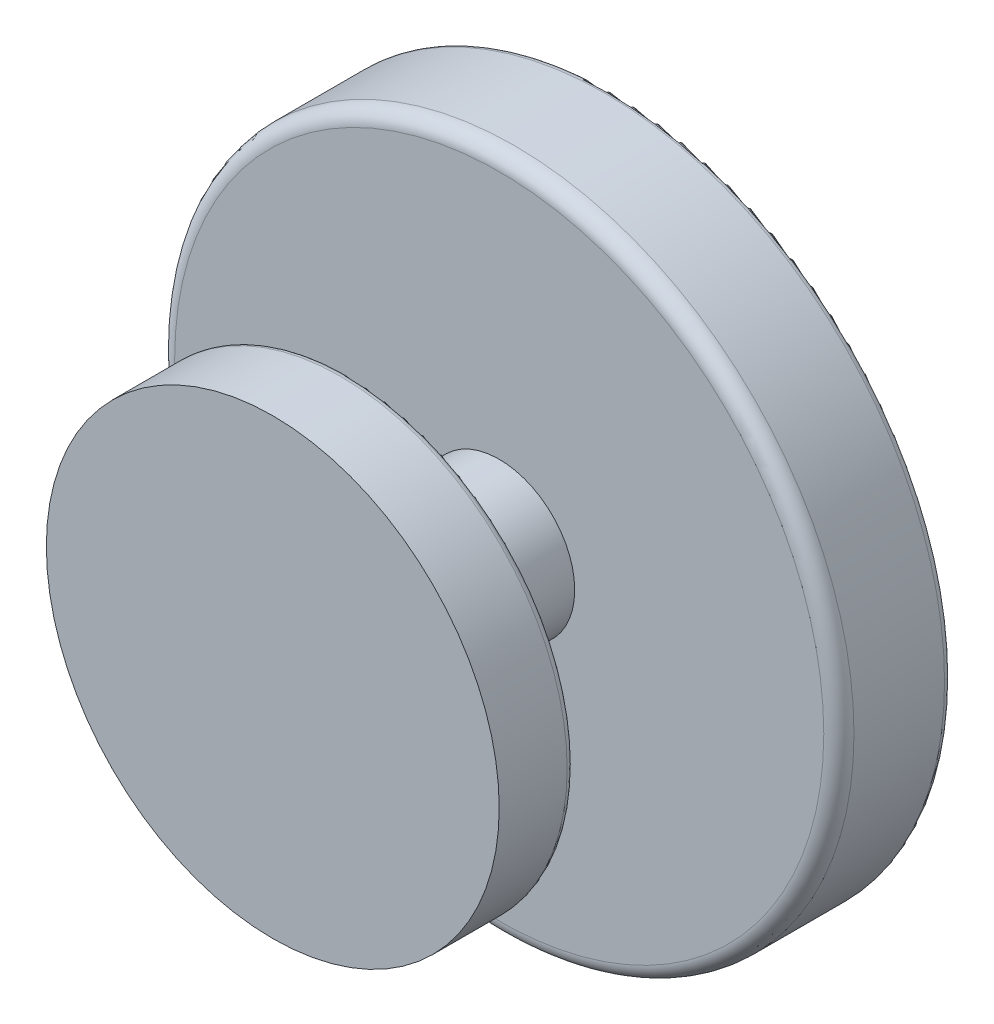
ISO-10303-21;
HEADER;
FILE_DESCRIPTION(('STEP AP214'),'2;1');
FILE_NAME('part.step','',(''),(''),'','','');
FILE_SCHEMA(('AUTOMOTIVE_DESIGN { 1 0 10303 214 1 1 1 1 }'));
ENDSEC;
DATA;
#1=APPLICATION_CONTEXT('core data for automotive mechanical design processes');
#2=APPLICATION_PROTOCOL_DEFINITION('international standard','automotive_design',2000,#1);
#3=PRODUCT_CONTEXT('',#1,'mechanical');
#4=PRODUCT('Part','Part','',(#3));
#5=PRODUCT_RELATED_PRODUCT_CATEGORY('part','',(#4));
#6=PRODUCT_DEFINITION_FORMATION('','',#4);
#7=PRODUCT_DEFINITION_CONTEXT('part definition',#1,'design');
#8=PRODUCT_DEFINITION('design','',#6,#7);
#9=PRODUCT_DEFINITION_SHAPE('','',#8);
#10=(LENGTH_UNIT() NAMED_UNIT(*) SI_UNIT(.MILLI.,.METRE.));
#11=(NAMED_UNIT(*) PLANE_ANGLE_UNIT() SI_UNIT($,.RADIAN.));
#12=(NAMED_UNIT(*) SI_UNIT($,.STERADIAN.) SOLID_ANGLE_UNIT());
#13=UNCERTAINTY_MEASURE_WITH_UNIT(LENGTH_MEASURE(1.E-05),#10,'distance_accuracy_value','');
#14=(GEOMETRIC_REPRESENTATION_CONTEXT(3) GLOBAL_UNCERTAINTY_ASSIGNED_CONTEXT((#13)) GLOBAL_UNIT_ASSIGNED_CONTEXT((#10,
#11,#12)) REPRESENTATION_CONTEXT('',''));
#15=CARTESIAN_POINT('',(0.,0.,0.));
#16=DIRECTION('',(0.,0.,1.));
#17=DIRECTION('',(1.,0.,0.));
#18=AXIS2_PLACEMENT_3D('',#15,#16,#17);
#19=CARTESIAN_POINT('',(0.,0.,15.));
#20=DIRECTION('',(0.,0.,1.));
#21=DIRECTION('',(1.,0.,0.));
#22=AXIS2_PLACEMENT_3D('',#19,#20,#21);
#23=PLANE('',#22);
#24=CARTESIAN_POINT('',(0.,0.,15.));
#25=DIRECTION('',(0.,0.,1.));
#26=DIRECTION('',(1.,0.,0.));
#27=AXIS2_PLACEMENT_3D('',#24,#25,#26);
#28=CIRCLE('',#27,43.);
#29=CARTESIAN_POINT('',(43.,0.,15.));
#30=VERTEX_POINT('',#29);
#31=EDGE_CURVE('E56',#30,#30,#28,.T.);
#32=ORIENTED_EDGE('',*,*,#31,.T.);
#33=EDGE_LOOP('',(#32));
#34=FACE_BOUND('',#33,.T.);
#35=CARTESIAN_POINT('',(0.,0.,15.));
#36=DIRECTION('',(0.,0.,1.));
#37=DIRECTION('',(1.,0.,0.));
#38=AXIS2_PLACEMENT_3D('',#35,#36,#37);
#39=CIRCLE('',#38,10.);
#40=CARTESIAN_POINT('',(10.,0.,15.));
#41=VERTEX_POINT('',#40);
#42=EDGE_CURVE('E60',#41,#41,#39,.T.);
#43=ORIENTED_EDGE('',*,*,#42,.F.);
#44=EDGE_LOOP('',(#43));
#45=FACE_BOUND('',#44,.T.);
#46=ADVANCED_FACE('F33',(#34,#45),#23,.T.);
#47=CARTESIAN_POINT('',(0.,0.,15.));
#48=DIRECTION('',(0.,0.,-1.));
#49=DIRECTION('',(-1.,0.,0.));
#50=AXIS2_PLACEMENT_3D('',#47,#48,#49);
#51=CYLINDRICAL_SURFACE('',#50,45.);
#52=CARTESIAN_POINT('',(0.,0.,1.));
#53=DIRECTION('',(0.,0.,1.));
#54=DIRECTION('',(1.,0.,0.));
#55=AXIS2_PLACEMENT_3D('',#52,#53,#54);
#56=CIRCLE('',#55,45.);
#57=CARTESIAN_POINT('',(45.,0.,1.));
#58=VERTEX_POINT('',#57);
#59=EDGE_CURVE('E40',#58,#58,#56,.T.);
#60=ORIENTED_EDGE('',*,*,#59,.T.);
#61=EDGE_LOOP('',(#60));
#62=FACE_BOUND('',#61,.T.);
#63=CARTESIAN_POINT('',(0.,0.,13.));
#64=DIRECTION('',(0.,0.,1.));
#65=DIRECTION('',(1.,0.,0.));
#66=AXIS2_PLACEMENT_3D('',#63,#64,#65);
#67=CIRCLE('',#66,45.);
#68=CARTESIAN_POINT('',(45.,0.,13.));
#69=VERTEX_POINT('',#68);
#70=EDGE_CURVE('E53',#69,#69,#67,.F.);
#71=ORIENTED_EDGE('',*,*,#70,.T.);
#72=EDGE_LOOP('',(#71));
#73=FACE_BOUND('',#72,.T.);
#74=ADVANCED_FACE('F87',(#62,#73),#51,.T.);
#75=CARTESIAN_POINT('',(0.,0.,0.));
#76=DIRECTION('',(0.,0.,1.));
#77=DIRECTION('',(1.,0.,0.));
#78=AXIS2_PLACEMENT_3D('',#75,#76,#77);
#79=PLANE('',#78);
#80=CARTESIAN_POINT('',(0.,0.,0.));
#81=DIRECTION('',(0.,0.,1.));
#82=DIRECTION('',(1.,0.,0.));
#83=AXIS2_PLACEMENT_3D('',#80,#81,#82);
#84=CIRCLE('',#83,44.);
#85=CARTESIAN_POINT('',(44.,0.,0.));
#86=VERTEX_POINT('',#85);
#87=EDGE_CURVE('E10',#86,#86,#84,.F.);
#88=ORIENTED_EDGE('',*,*,#87,.T.);
#89=EDGE_LOOP('',(#88));
#90=FACE_BOUND('',#89,.T.);
#91=ADVANCED_FACE('F93',(#90),#79,.F.);
#92=CARTESIAN_POINT('',(0.,0.,35.));
#93=DIRECTION('',(0.,0.,-1.));
#94=DIRECTION('',(-1.,0.,0.));
#95=AXIS2_PLACEMENT_3D('',#92,#93,#94);
#96=CYLINDRICAL_SURFACE('',#95,10.);
#97=CARTESIAN_POINT('',(0.,0.,35.));
#98=DIRECTION('',(0.,0.,1.));
#99=DIRECTION('',(1.,0.,0.));
#100=AXIS2_PLACEMENT_3D('',#97,#98,#99);
#101=CIRCLE('',#100,10.);
#102=CARTESIAN_POINT('',(10.,0.,35.));
#103=VERTEX_POINT('',#102);
#104=EDGE_CURVE('E59',#103,#103,#101,.T.);
#105=ORIENTED_EDGE('',*,*,#104,.F.);
#106=EDGE_LOOP('',(#105));
#107=FACE_BOUND('',#106,.T.);
#108=ORIENTED_EDGE('',*,*,#42,.T.);
#109=EDGE_LOOP('',(#108));
#110=FACE_BOUND('',#109,.T.);
#111=ADVANCED_FACE('F82',(#107,#110),#96,.T.);
#112=CARTESIAN_POINT('',(0.,0.,35.));
#113=DIRECTION('',(0.,0.,1.));
#114=DIRECTION('',(1.,0.,0.));
#115=AXIS2_PLACEMENT_3D('',#112,#113,#114);
#116=PLANE('',#115);
#117=CARTESIAN_POINT('',(0.,0.,35.));
#118=DIRECTION('',(0.,0.,1.));
#119=DIRECTION('',(1.,0.,0.));
#120=AXIS2_PLACEMENT_3D('',#117,#118,#119);
#121=CIRCLE('',#120,29.);
#122=CARTESIAN_POINT('',(29.,0.,35.));
#123=VERTEX_POINT('',#122);
#124=EDGE_CURVE('E44',#123,#123,#121,.F.);
#125=ORIENTED_EDGE('',*,*,#124,.T.);
#126=EDGE_LOOP('',(#125));
#127=FACE_BOUND('',#126,.T.);
#128=ORIENTED_EDGE('',*,*,#104,.T.);
#129=EDGE_LOOP('',(#128));
#130=FACE_BOUND('',#129,.T.);
#131=ADVANCED_FACE('F73',(#127,#130),#116,.F.);
#132=CARTESIAN_POINT('',(0.,0.,45.));
#133=DIRECTION('',(0.,0.,-1.));
#134=DIRECTION('',(-1.,0.,0.));
#135=AXIS2_PLACEMENT_3D('',#132,#133,#134);
#136=CYLINDRICAL_SURFACE('',#135,30.);
#137=CARTESIAN_POINT('',(0.,0.,36.));
#138=DIRECTION('',(0.,0.,1.));
#139=DIRECTION('',(1.,0.,0.));
#140=AXIS2_PLACEMENT_3D('',#137,#138,#139);
#141=CIRCLE('',#140,30.);
#142=CARTESIAN_POINT('',(30.,0.,36.));
#143=VERTEX_POINT('',#142);
#144=EDGE_CURVE('E48',#143,#143,#141,.T.);
#145=ORIENTED_EDGE('',*,*,#144,.T.);
#146=EDGE_LOOP('',(#145));
#147=FACE_BOUND('',#146,.T.);
#148=CARTESIAN_POINT('',(0.,0.,45.));
#149=DIRECTION('',(0.,0.,1.));
#150=DIRECTION('',(1.,0.,0.));
#151=AXIS2_PLACEMENT_3D('',#148,#149,#150);
#152=CIRCLE('',#151,30.);
#153=CARTESIAN_POINT('',(30.,0.,45.));
#154=VERTEX_POINT('',#153);
#155=EDGE_CURVE('E63',#154,#154,#152,.T.);
#156=ORIENTED_EDGE('',*,*,#155,.F.);
#157=EDGE_LOOP('',(#156));
#158=FACE_BOUND('',#157,.T.);
#159=ADVANCED_FACE('F71',(#147,#158),#136,.T.);
#160=CARTESIAN_POINT('',(0.,0.,45.));
#161=DIRECTION('',(0.,0.,1.));
#162=DIRECTION('',(1.,0.,0.));
#163=AXIS2_PLACEMENT_3D('',#160,#161,#162);
#164=PLANE('',#163);
#165=ORIENTED_EDGE('',*,*,#155,.T.);
#166=EDGE_LOOP('',(#165));
#167=FACE_BOUND('',#166,.T.);
#168=ADVANCED_FACE('F69',(#167),#164,.T.);
#169=CARTESIAN_POINT('',(0.,0.,13.));
#170=DIRECTION('',(0.,0.,1.));
#171=DIRECTION('',(1.,0.,0.));
#172=AXIS2_PLACEMENT_3D('',#169,#170,#171);
#173=TOROIDAL_SURFACE('',#172,43.,2.);
#174=ORIENTED_EDGE('',*,*,#70,.F.);
#175=EDGE_LOOP('',(#174));
#176=FACE_BOUND('',#175,.T.);
#177=ORIENTED_EDGE('',*,*,#31,.F.);
#178=EDGE_LOOP('',(#177));
#179=FACE_BOUND('',#178,.T.);
#180=ADVANCED_FACE('F80',(#176,#179),#173,.T.);
#181=CARTESIAN_POINT('',(0.,0.,36.));
#182=DIRECTION('',(0.,0.,1.));
#183=DIRECTION('',(1.,0.,0.));
#184=AXIS2_PLACEMENT_3D('',#181,#182,#183);
#185=TOROIDAL_SURFACE('',#184,29.,1.);
#186=ORIENTED_EDGE('',*,*,#124,.F.);
#187=EDGE_LOOP('',(#186));
#188=FACE_BOUND('',#187,.T.);
#189=ORIENTED_EDGE('',*,*,#144,.F.);
#190=EDGE_LOOP('',(#189));
#191=FACE_BOUND('',#190,.T.);
#192=ADVANCED_FACE('F100',(#188,#191),#185,.T.);
#193=CARTESIAN_POINT('',(0.,0.,1.));
#194=DIRECTION('',(0.,0.,1.));
#195=DIRECTION('',(1.,0.,0.));
#196=AXIS2_PLACEMENT_3D('',#193,#194,#195);
#197=TOROIDAL_SURFACE('',#196,44.,1.);
#198=ORIENTED_EDGE('',*,*,#87,.F.);
#199=EDGE_LOOP('',(#198));
#200=FACE_BOUND('',#199,.T.);
#201=ORIENTED_EDGE('',*,*,#59,.F.);
#202=EDGE_LOOP('',(#201));
#203=FACE_BOUND('',#202,.T.);
#204=ADVANCED_FACE('F35',(#200,#203),#197,.T.);
#205=CLOSED_SHELL('',(#46,#74,#91,#111,#131,#159,#168,#180,#192,#204));
#206=MANIFOLD_SOLID_BREP('B2',#205);
#207=ADVANCED_BREP_SHAPE_REPRESENTATION('',(#18,#206),#14);
#208=SHAPE_DEFINITION_REPRESENTATION(#9,#207);
ENDSEC;
END-ISO-10303-21;
